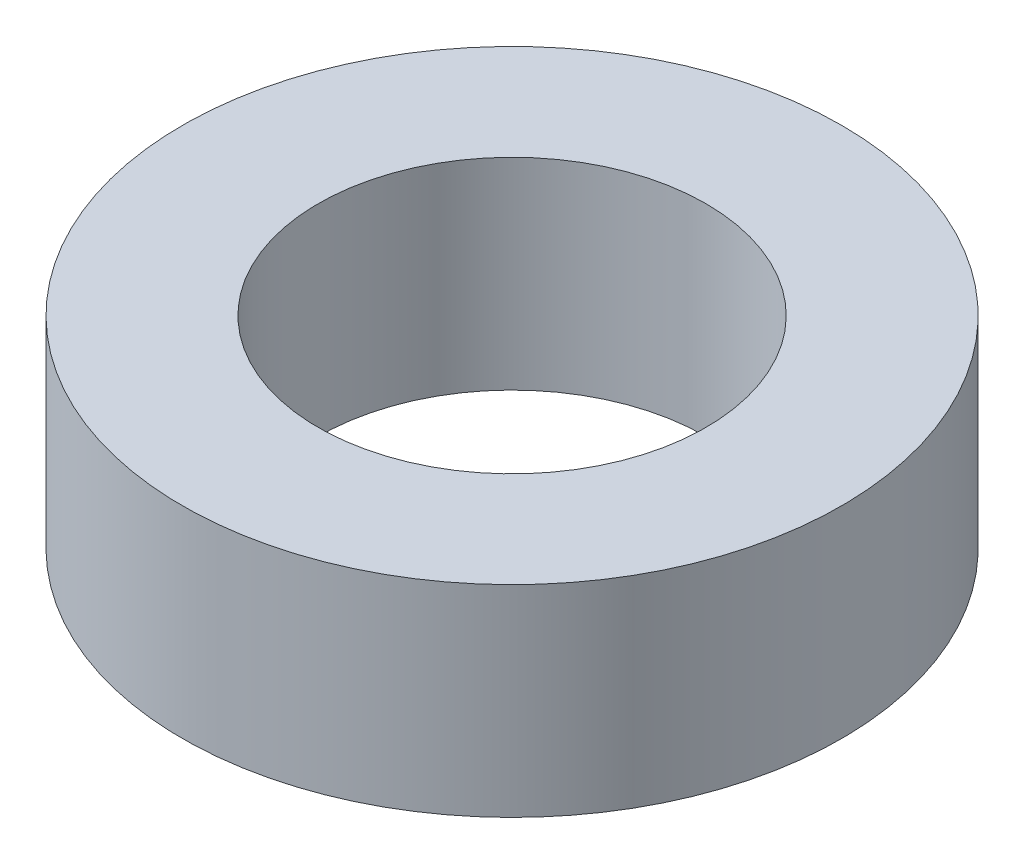
ISO-10303-21;
HEADER;
FILE_DESCRIPTION(('STEP AP214'),'2;1');
FILE_NAME('part.step','',(''),(''),'','','');
FILE_SCHEMA(('AUTOMOTIVE_DESIGN { 1 0 10303 214 1 1 1 1 }'));
ENDSEC;
DATA;
#1=APPLICATION_CONTEXT('core data for automotive mechanical design processes');
#2=APPLICATION_PROTOCOL_DEFINITION('international standard','automotive_design',2000,#1);
#3=PRODUCT_CONTEXT('',#1,'mechanical');
#4=PRODUCT('Part','Part','',(#3));
#5=PRODUCT_RELATED_PRODUCT_CATEGORY('part','',(#4));
#6=PRODUCT_DEFINITION_FORMATION('','',#4);
#7=PRODUCT_DEFINITION_CONTEXT('part definition',#1,'design');
#8=PRODUCT_DEFINITION('design','',#6,#7);
#9=PRODUCT_DEFINITION_SHAPE('','',#8);
#10=(LENGTH_UNIT() NAMED_UNIT(*) SI_UNIT(.MILLI.,.METRE.));
#11=(NAMED_UNIT(*) PLANE_ANGLE_UNIT() SI_UNIT($,.RADIAN.));
#12=(NAMED_UNIT(*) SI_UNIT($,.STERADIAN.) SOLID_ANGLE_UNIT());
#13=UNCERTAINTY_MEASURE_WITH_UNIT(LENGTH_MEASURE(1.E-05),#10,'distance_accuracy_value','');
#14=(GEOMETRIC_REPRESENTATION_CONTEXT(3) GLOBAL_UNCERTAINTY_ASSIGNED_CONTEXT((#13)) GLOBAL_UNIT_ASSIGNED_CONTEXT((#10,
#11,#12)) REPRESENTATION_CONTEXT('',''));
#15=CARTESIAN_POINT('',(0.,0.,0.));
#16=DIRECTION('',(0.,0.,1.));
#17=DIRECTION('',(1.,0.,0.));
#18=AXIS2_PLACEMENT_3D('',#15,#16,#17);
#19=CARTESIAN_POINT('',(0.,26.,0.));
#20=DIRECTION('',(0.,-1.,0.));
#21=DIRECTION('',(0.,0.,-1.));
#22=AXIS2_PLACEMENT_3D('',#19,#20,#21);
#23=CYLINDRICAL_SURFACE('',#22,42.5);
#24=CARTESIAN_POINT('',(0.,26.,0.));
#25=DIRECTION('',(0.,1.,0.));
#26=DIRECTION('',(0.,0.,1.));
#27=AXIS2_PLACEMENT_3D('',#24,#25,#26);
#28=CIRCLE('',#27,42.5);
#29=CARTESIAN_POINT('',(0.,26.,-42.5));
#30=VERTEX_POINT('',#29);
#31=EDGE_CURVE('E10',#30,#30,#28,.T.);
#32=CARTESIAN_POINT('',(0.,0.,0.));
#33=DIRECTION('',(0.,1.,0.));
#34=DIRECTION('',(0.,0.,1.));
#35=AXIS2_PLACEMENT_3D('',#32,#33,#34);
#36=CIRCLE('',#35,42.5);
#37=CARTESIAN_POINT('',(0.,0.,-42.5));
#38=VERTEX_POINT('',#37);
#39=EDGE_CURVE('E37',#38,#38,#36,.T.);
#40=CARTESIAN_POINT('',(0.,26.,-42.5));
#41=CARTESIAN_POINT('',(0.,25.7291666666667,-42.5));
#42=CARTESIAN_POINT('',(0.,25.4583333333333,-42.5));
#43=CARTESIAN_POINT('',(0.,24.9166666666667,-42.5));
#44=CARTESIAN_POINT('',(0.,24.6458333333333,-42.5));
#45=CARTESIAN_POINT('',(0.,24.1041666666667,-42.5));
#46=CARTESIAN_POINT('',(0.,23.8333333333333,-42.5));
#47=CARTESIAN_POINT('',(0.,23.2916666666667,-42.5));
#48=CARTESIAN_POINT('',(0.,23.0208333333333,-42.5));
#49=CARTESIAN_POINT('',(0.,22.4791666666667,-42.5));
#50=CARTESIAN_POINT('',(0.,22.2083333333333,-42.5));
#51=CARTESIAN_POINT('',(0.,21.6666666666667,-42.5));
#52=CARTESIAN_POINT('',(0.,21.3958333333333,-42.5));
#53=CARTESIAN_POINT('',(0.,20.8541666666667,-42.5));
#54=CARTESIAN_POINT('',(0.,20.5833333333333,-42.5));
#55=CARTESIAN_POINT('',(0.,20.0416666666667,-42.5));
#56=CARTESIAN_POINT('',(0.,19.7708333333333,-42.5));
#57=CARTESIAN_POINT('',(0.,19.2291666666667,-42.5));
#58=CARTESIAN_POINT('',(0.,18.9583333333333,-42.5));
#59=CARTESIAN_POINT('',(0.,18.4166666666667,-42.5));
#60=CARTESIAN_POINT('',(0.,18.1458333333333,-42.5));
#61=CARTESIAN_POINT('',(0.,17.6041666666667,-42.5));
#62=CARTESIAN_POINT('',(0.,17.3333333333333,-42.5));
#63=CARTESIAN_POINT('',(0.,16.7916666666667,-42.5));
#64=CARTESIAN_POINT('',(0.,16.5208333333333,-42.5));
#65=CARTESIAN_POINT('',(0.,15.9791666666667,-42.5));
#66=CARTESIAN_POINT('',(0.,15.7083333333333,-42.5));
#67=CARTESIAN_POINT('',(0.,15.1666666666667,-42.5));
#68=CARTESIAN_POINT('',(0.,14.8958333333333,-42.5));
#69=CARTESIAN_POINT('',(0.,14.3541666666667,-42.5));
#70=CARTESIAN_POINT('',(0.,14.0833333333333,-42.5));
#71=CARTESIAN_POINT('',(0.,13.5416666666667,-42.5));
#72=CARTESIAN_POINT('',(0.,13.2708333333333,-42.5));
#73=CARTESIAN_POINT('',(0.,12.7291666666667,-42.5));
#74=CARTESIAN_POINT('',(0.,12.4583333333333,-42.5));
#75=CARTESIAN_POINT('',(0.,11.9166666666667,-42.5));
#76=CARTESIAN_POINT('',(0.,11.6458333333333,-42.5));
#77=CARTESIAN_POINT('',(0.,11.1041666666667,-42.5));
#78=CARTESIAN_POINT('',(0.,10.8333333333333,-42.5));
#79=CARTESIAN_POINT('',(0.,10.2916666666667,-42.5));
#80=CARTESIAN_POINT('',(0.,10.0208333333333,-42.5));
#81=CARTESIAN_POINT('',(0.,9.47916666666667,-42.5));
#82=CARTESIAN_POINT('',(0.,9.20833333333333,-42.5));
#83=CARTESIAN_POINT('',(0.,8.66666666666667,-42.5));
#84=CARTESIAN_POINT('',(0.,8.39583333333333,-42.5));
#85=CARTESIAN_POINT('',(0.,7.85416666666667,-42.5));
#86=CARTESIAN_POINT('',(0.,7.58333333333333,-42.5));
#87=CARTESIAN_POINT('',(0.,7.04166666666667,-42.5));
#88=CARTESIAN_POINT('',(0.,6.77083333333333,-42.5));
#89=CARTESIAN_POINT('',(0.,6.22916666666667,-42.5));
#90=CARTESIAN_POINT('',(0.,5.95833333333333,-42.5));
#91=CARTESIAN_POINT('',(0.,5.41666666666667,-42.5));
#92=CARTESIAN_POINT('',(0.,5.14583333333333,-42.5));
#93=CARTESIAN_POINT('',(0.,4.60416666666667,-42.5));
#94=CARTESIAN_POINT('',(0.,4.33333333333333,-42.5));
#95=CARTESIAN_POINT('',(0.,3.79166666666667,-42.5));
#96=CARTESIAN_POINT('',(0.,3.52083333333333,-42.5));
#97=CARTESIAN_POINT('',(0.,2.97916666666667,-42.5));
#98=CARTESIAN_POINT('',(0.,2.70833333333333,-42.5));
#99=CARTESIAN_POINT('',(0.,2.16666666666667,-42.5));
#100=CARTESIAN_POINT('',(0.,1.89583333333333,-42.5));
#101=CARTESIAN_POINT('',(0.,1.35416666666667,-42.5));
#102=CARTESIAN_POINT('',(0.,1.08333333333333,-42.5));
#103=CARTESIAN_POINT('',(0.,0.541666666666667,-42.5));
#104=CARTESIAN_POINT('',(0.,0.270833333333334,-42.5));
#105=CARTESIAN_POINT('',(0.,0.,-42.5));
#106=B_SPLINE_CURVE_WITH_KNOTS('',3,(#40,#41,#42,#43,#44,#45,#46,#47,#48,#49,#50,#51,#52,#53,
#54,#55,#56,#57,#58,#59,#60,#61,#62,#63,#64,#65,#66,#67,#68,#69,#70,#71,#72,#73,#74,#75,#76,#77,
#78,#79,#80,#81,#82,#83,#84,#85,#86,#87,#88,#89,#90,#91,#92,#93,#94,#95,#96,#97,#98,#99,#100,
#101,#102,#103,#104,#105),.UNSPECIFIED.,.F.,.F.,(4,2,2,2,2,2,2,2,2,2,2,2,2,2,2,2,2,2,2,2,2,2,2,
2,2,2,2,2,2,2,2,2,4),(0.,0.812499999999997,1.625,2.4375,3.25,4.0625,4.875,5.6875,6.5,7.3125,
8.125,8.93749999999999,9.74999999999999,10.5625,11.375,12.1875,13.,13.8125,14.625,15.4375,16.25,
17.0625,17.875,18.6875,19.5,20.3125,21.125,21.9375,22.75,23.5625,24.375,25.1875,26.),.UNSPECIFIED.);
#107=EDGE_CURVE('BSEAM40',#30,#38,#106,.T.);
#108=ORIENTED_EDGE('',*,*,#31,.F.);
#109=ORIENTED_EDGE('',*,*,#39,.T.);
#110=ORIENTED_EDGE('',*,*,#107,.T.);
#111=ORIENTED_EDGE('',*,*,#107,.F.);
#112=EDGE_LOOP('',(#108,#110,#109,#111));
#113=FACE_BOUND('',#112,.T.);
#114=ADVANCED_FACE('F40',(#113),#23,.T.);
#115=CARTESIAN_POINT('',(0.,26.,0.));
#116=DIRECTION('',(0.,1.,0.));
#117=DIRECTION('',(0.,0.,1.));
#118=AXIS2_PLACEMENT_3D('',#115,#116,#117);
#119=PLANE('',#118);
#120=CARTESIAN_POINT('',(0.,26.,0.));
#121=DIRECTION('',(0.,1.,0.));
#122=DIRECTION('',(0.,0.,1.));
#123=AXIS2_PLACEMENT_3D('',#120,#121,#122);
#124=CIRCLE('',#123,25.);
#125=CARTESIAN_POINT('',(0.,26.,-25.));
#126=VERTEX_POINT('',#125);
#127=EDGE_CURVE('E50',#126,#126,#124,.T.);
#128=ORIENTED_EDGE('',*,*,#127,.F.);
#129=EDGE_LOOP('',(#128));
#130=FACE_BOUND('',#129,.T.);
#131=ORIENTED_EDGE('',*,*,#31,.T.);
#132=EDGE_LOOP('',(#131));
#133=FACE_BOUND('',#132,.T.);
#134=ADVANCED_FACE('F59',(#130,#133),#119,.T.);
#135=CARTESIAN_POINT('',(0.,0.,0.));
#136=DIRECTION('',(0.,1.,0.));
#137=DIRECTION('',(0.,0.,1.));
#138=AXIS2_PLACEMENT_3D('',#135,#136,#137);
#139=PLANE('',#138);
#140=CARTESIAN_POINT('',(0.,0.,0.));
#141=DIRECTION('',(0.,1.,0.));
#142=DIRECTION('',(0.,0.,1.));
#143=AXIS2_PLACEMENT_3D('',#140,#141,#142);
#144=CIRCLE('',#143,25.);
#145=CARTESIAN_POINT('',(0.,0.,-25.));
#146=VERTEX_POINT('',#145);
#147=EDGE_CURVE('E47',#146,#146,#144,.T.);
#148=ORIENTED_EDGE('',*,*,#147,.T.);
#149=EDGE_LOOP('',(#148));
#150=FACE_BOUND('',#149,.T.);
#151=ORIENTED_EDGE('',*,*,#39,.F.);
#152=EDGE_LOOP('',(#151));
#153=FACE_BOUND('',#152,.T.);
#154=ADVANCED_FACE('F58',(#150,#153),#139,.F.);
#155=CARTESIAN_POINT('',(0.,26.,0.));
#156=DIRECTION('',(0.,-1.,0.));
#157=DIRECTION('',(0.,0.,-1.));
#158=AXIS2_PLACEMENT_3D('',#155,#156,#157);
#159=CYLINDRICAL_SURFACE('',#158,25.);
#160=CARTESIAN_POINT('',(0.,26.,-25.));
#161=CARTESIAN_POINT('',(0.,25.7291666666667,-25.));
#162=CARTESIAN_POINT('',(0.,25.4583333333333,-25.));
#163=CARTESIAN_POINT('',(0.,24.9166666666667,-25.));
#164=CARTESIAN_POINT('',(0.,24.6458333333333,-25.));
#165=CARTESIAN_POINT('',(0.,24.1041666666667,-25.));
#166=CARTESIAN_POINT('',(0.,23.8333333333333,-25.));
#167=CARTESIAN_POINT('',(0.,23.2916666666667,-25.));
#168=CARTESIAN_POINT('',(0.,23.0208333333333,-25.));
#169=CARTESIAN_POINT('',(0.,22.4791666666667,-25.));
#170=CARTESIAN_POINT('',(0.,22.2083333333333,-25.));
#171=CARTESIAN_POINT('',(0.,21.6666666666667,-25.));
#172=CARTESIAN_POINT('',(0.,21.3958333333333,-25.));
#173=CARTESIAN_POINT('',(0.,20.8541666666667,-25.));
#174=CARTESIAN_POINT('',(0.,20.5833333333333,-25.));
#175=CARTESIAN_POINT('',(0.,20.0416666666667,-25.));
#176=CARTESIAN_POINT('',(0.,19.7708333333333,-25.));
#177=CARTESIAN_POINT('',(0.,19.2291666666667,-25.));
#178=CARTESIAN_POINT('',(0.,18.9583333333333,-25.));
#179=CARTESIAN_POINT('',(0.,18.4166666666667,-25.));
#180=CARTESIAN_POINT('',(0.,18.1458333333333,-25.));
#181=CARTESIAN_POINT('',(0.,17.6041666666667,-25.));
#182=CARTESIAN_POINT('',(0.,17.3333333333333,-25.));
#183=CARTESIAN_POINT('',(0.,16.7916666666667,-25.));
#184=CARTESIAN_POINT('',(0.,16.5208333333333,-25.));
#185=CARTESIAN_POINT('',(0.,15.9791666666667,-25.));
#186=CARTESIAN_POINT('',(0.,15.7083333333333,-25.));
#187=CARTESIAN_POINT('',(0.,15.1666666666667,-25.));
#188=CARTESIAN_POINT('',(0.,14.8958333333333,-25.));
#189=CARTESIAN_POINT('',(0.,14.3541666666667,-25.));
#190=CARTESIAN_POINT('',(0.,14.0833333333333,-25.));
#191=CARTESIAN_POINT('',(0.,13.5416666666667,-25.));
#192=CARTESIAN_POINT('',(0.,13.2708333333333,-25.));
#193=CARTESIAN_POINT('',(0.,12.7291666666667,-25.));
#194=CARTESIAN_POINT('',(0.,12.4583333333333,-25.));
#195=CARTESIAN_POINT('',(0.,11.9166666666667,-25.));
#196=CARTESIAN_POINT('',(0.,11.6458333333333,-25.));
#197=CARTESIAN_POINT('',(0.,11.1041666666667,-25.));
#198=CARTESIAN_POINT('',(0.,10.8333333333333,-25.));
#199=CARTESIAN_POINT('',(0.,10.2916666666667,-25.));
#200=CARTESIAN_POINT('',(0.,10.0208333333333,-25.));
#201=CARTESIAN_POINT('',(0.,9.47916666666667,-25.));
#202=CARTESIAN_POINT('',(0.,9.20833333333333,-25.));
#203=CARTESIAN_POINT('',(0.,8.66666666666667,-25.));
#204=CARTESIAN_POINT('',(0.,8.39583333333333,-25.));
#205=CARTESIAN_POINT('',(0.,7.85416666666667,-25.));
#206=CARTESIAN_POINT('',(0.,7.58333333333333,-25.));
#207=CARTESIAN_POINT('',(0.,7.04166666666667,-25.));
#208=CARTESIAN_POINT('',(0.,6.77083333333333,-25.));
#209=CARTESIAN_POINT('',(0.,6.22916666666667,-25.));
#210=CARTESIAN_POINT('',(0.,5.95833333333333,-25.));
#211=CARTESIAN_POINT('',(0.,5.41666666666667,-25.));
#212=CARTESIAN_POINT('',(0.,5.14583333333333,-25.));
#213=CARTESIAN_POINT('',(0.,4.60416666666667,-25.));
#214=CARTESIAN_POINT('',(0.,4.33333333333333,-25.));
#215=CARTESIAN_POINT('',(0.,3.79166666666667,-25.));
#216=CARTESIAN_POINT('',(0.,3.52083333333333,-25.));
#217=CARTESIAN_POINT('',(0.,2.97916666666667,-25.));
#218=CARTESIAN_POINT('',(0.,2.70833333333333,-25.));
#219=CARTESIAN_POINT('',(0.,2.16666666666667,-25.));
#220=CARTESIAN_POINT('',(0.,1.89583333333333,-25.));
#221=CARTESIAN_POINT('',(0.,1.35416666666667,-25.));
#222=CARTESIAN_POINT('',(0.,1.08333333333333,-25.));
#223=CARTESIAN_POINT('',(0.,0.541666666666667,-25.));
#224=CARTESIAN_POINT('',(0.,0.270833333333334,-25.));
#225=CARTESIAN_POINT('',(0.,0.,-25.));
#226=B_SPLINE_CURVE_WITH_KNOTS('',3,(#160,#161,#162,#163,#164,#165,#166,#167,#168,#169,#170,
#171,#172,#173,#174,#175,#176,#177,#178,#179,#180,#181,#182,#183,#184,#185,#186,#187,#188,#189,
#190,#191,#192,#193,#194,#195,#196,#197,#198,#199,#200,#201,#202,#203,#204,#205,#206,#207,#208,
#209,#210,#211,#212,#213,#214,#215,#216,#217,#218,#219,#220,#221,#222,#223,#224,#225),
.UNSPECIFIED.,.F.,.F.,(4,2,2,2,2,2,2,2,2,2,2,2,2,2,2,2,2,2,2,2,2,2,2,2,2,2,2,2,2,2,2,2,4),(0.,
0.812500000000001,1.625,2.4375,3.25,4.0625,4.875,5.6875,6.5,7.3125,8.125,8.9375,9.75,10.5625,
11.375,12.1875,13.,13.8125,14.625,15.4375,16.25,17.0625,17.875,18.6875,19.5,20.3125,21.125,
21.9375,22.75,23.5625,24.375,25.1875,26.),.UNSPECIFIED.);
#227=EDGE_CURVE('BSEAM54',#126,#146,#226,.T.);
#228=ORIENTED_EDGE('',*,*,#127,.T.);
#229=ORIENTED_EDGE('',*,*,#147,.F.);
#230=ORIENTED_EDGE('',*,*,#227,.T.);
#231=ORIENTED_EDGE('',*,*,#227,.F.);
#232=EDGE_LOOP('',(#228,#230,#229,#231));
#233=FACE_BOUND('',#232,.T.);
#234=ADVANCED_FACE('F54',(#233),#159,.F.);
#235=CLOSED_SHELL('',(#114,#134,#154,#234));
#236=MANIFOLD_SOLID_BREP('B2',#235);
#237=ADVANCED_BREP_SHAPE_REPRESENTATION('',(#18,#236),#14);
#238=SHAPE_DEFINITION_REPRESENTATION(#9,#237);
ENDSEC;
END-ISO-10303-21;
